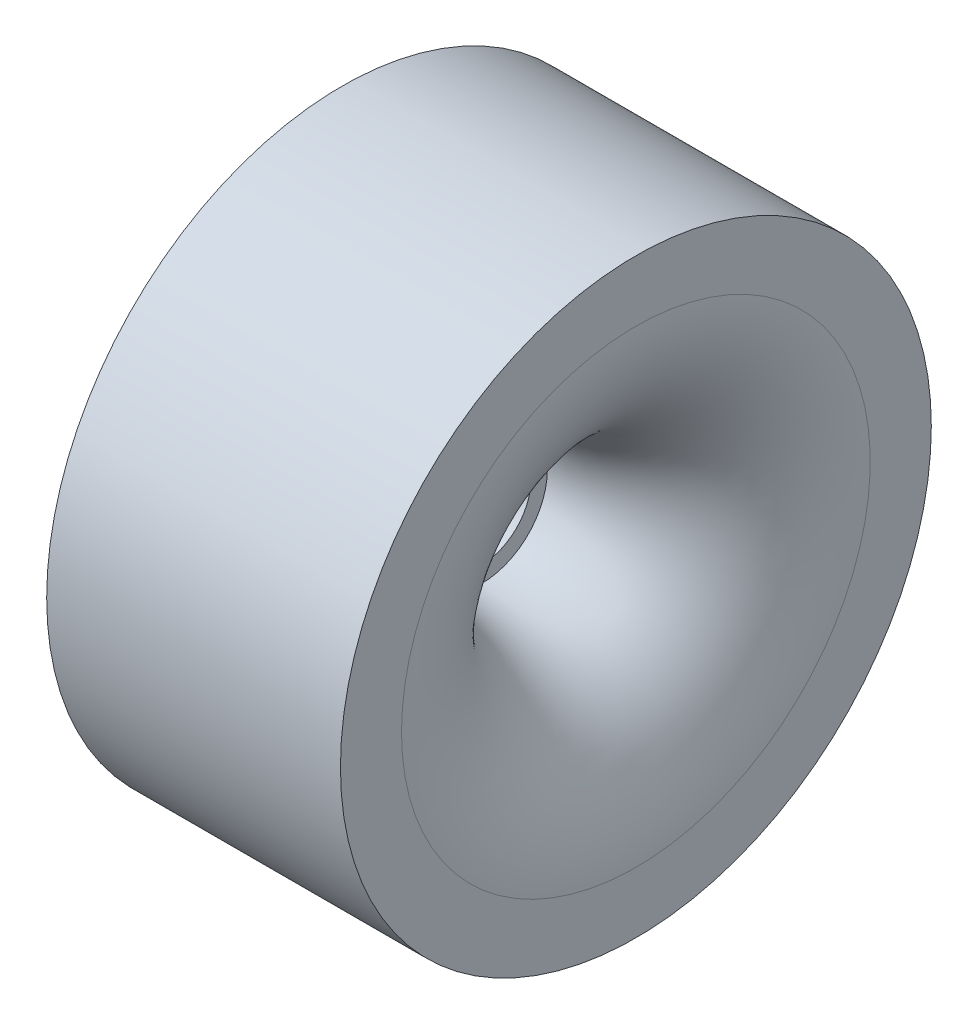
ISO-10303-21;
HEADER;
FILE_DESCRIPTION(('STEP AP214'),'2;1');
FILE_NAME('part.step','',(''),(''),'','','');
FILE_SCHEMA(('AUTOMOTIVE_DESIGN { 1 0 10303 214 1 1 1 1 }'));
ENDSEC;
DATA;
#1=APPLICATION_CONTEXT('core data for automotive mechanical design processes');
#2=APPLICATION_PROTOCOL_DEFINITION('international standard','automotive_design',2000,#1);
#3=PRODUCT_CONTEXT('',#1,'mechanical');
#4=PRODUCT('Part','Part','',(#3));
#5=PRODUCT_RELATED_PRODUCT_CATEGORY('part','',(#4));
#6=PRODUCT_DEFINITION_FORMATION('','',#4);
#7=PRODUCT_DEFINITION_CONTEXT('part definition',#1,'design');
#8=PRODUCT_DEFINITION('design','',#6,#7);
#9=PRODUCT_DEFINITION_SHAPE('','',#8);
#10=(LENGTH_UNIT() NAMED_UNIT(*) SI_UNIT(.MILLI.,.METRE.));
#11=(NAMED_UNIT(*) PLANE_ANGLE_UNIT() SI_UNIT($,.RADIAN.));
#12=(NAMED_UNIT(*) SI_UNIT($,.STERADIAN.) SOLID_ANGLE_UNIT());
#13=UNCERTAINTY_MEASURE_WITH_UNIT(LENGTH_MEASURE(1.E-05),#10,'distance_accuracy_value','');
#14=(GEOMETRIC_REPRESENTATION_CONTEXT(3) GLOBAL_UNCERTAINTY_ASSIGNED_CONTEXT((#13)) GLOBAL_UNIT_ASSIGNED_CONTEXT((#10,
#11,#12)) REPRESENTATION_CONTEXT('',''));
#15=CARTESIAN_POINT('',(0.,0.,0.));
#16=DIRECTION('',(0.,0.,1.));
#17=DIRECTION('',(1.,0.,0.));
#18=AXIS2_PLACEMENT_3D('',#15,#16,#17);
#19=CARTESIAN_POINT('',(-1.2624502584883,0.,0.));
#20=DIRECTION('',(-1.,0.,0.));
#21=DIRECTION('',(0.,0.,1.));
#22=AXIS2_PLACEMENT_3D('',#19,#20,#21);
#23=TOROIDAL_SURFACE('',#22,23.5424885289266,16.9327586047467);
#24=CARTESIAN_POINT('',(15.6677215353421,0.,0.));
#25=DIRECTION('',(-1.,0.,0.));
#26=DIRECTION('',(0.,0.,1.));
#27=AXIS2_PLACEMENT_3D('',#24,#25,#26);
#28=CIRCLE('',#27,23.8384564292343);
#29=CARTESIAN_POINT('',(15.6677215353421,0.,23.8384564292343));
#30=VERTEX_POINT('',#29);
#31=EDGE_CURVE('E58',#30,#30,#28,.T.);
#32=ORIENTED_EDGE('',*,*,#31,.F.);
#33=EDGE_LOOP('',(#32));
#34=FACE_BOUND('',#33,.T.);
#35=CARTESIAN_POINT('',(0.,0.,0.));
#36=DIRECTION('',(1.,0.,0.));
#37=DIRECTION('',(0.,0.,-1.));
#38=AXIS2_PLACEMENT_3D('',#35,#36,#37);
#39=CIRCLE('',#38,6.65685755725529);
#40=CARTESIAN_POINT('',(0.,0.,-6.65685755725529));
#41=VERTEX_POINT('',#40);
#42=EDGE_CURVE('E61',#41,#41,#39,.T.);
#43=ORIENTED_EDGE('',*,*,#42,.F.);
#44=EDGE_LOOP('',(#43));
#45=FACE_BOUND('',#44,.T.);
#46=ADVANCED_FACE('F36',(#34,#45),#23,.T.);
#47=CARTESIAN_POINT('',(1.18604739143028,0.,0.));
#48=DIRECTION('',(-1.,0.,0.));
#49=DIRECTION('',(0.,0.,1.));
#50=AXIS2_PLACEMENT_3D('',#47,#48,#49);
#51=TOROIDAL_SURFACE('',#50,22.5376224794024,12.0952546356603);
#52=CARTESIAN_POINT('',(0.,0.,0.));
#53=DIRECTION('',(-1.,0.,0.));
#54=DIRECTION('',(0.,0.,1.));
#55=AXIS2_PLACEMENT_3D('',#52,#53,#54);
#56=CIRCLE('',#55,10.5006595615089);
#57=CARTESIAN_POINT('',(0.,0.,10.5006595615089));
#58=VERTEX_POINT('',#57);
#59=EDGE_CURVE('E10',#58,#58,#56,.T.);
#60=ORIENTED_EDGE('',*,*,#59,.F.);
#61=EDGE_LOOP('',(#60));
#62=FACE_BOUND('',#61,.T.);
#63=CARTESIAN_POINT('',(13.2111467979394,0.,0.));
#64=DIRECTION('',(-1.,0.,0.));
#65=DIRECTION('',(0.,0.,1.));
#66=AXIS2_PLACEMENT_3D('',#63,#64,#65);
#67=CIRCLE('',#66,23.8384564292343);
#68=CARTESIAN_POINT('',(13.2111467979394,0.,23.8384564292343));
#69=VERTEX_POINT('',#68);
#70=EDGE_CURVE('E42',#69,#69,#67,.T.);
#71=ORIENTED_EDGE('',*,*,#70,.T.);
#72=EDGE_LOOP('',(#71));
#73=FACE_BOUND('',#72,.T.);
#74=ADVANCED_FACE('F94',(#62,#73),#51,.F.);
#75=CARTESIAN_POINT('',(0.,0.,0.));
#76=DIRECTION('',(-1.,0.,0.));
#77=DIRECTION('',(0.,0.,1.));
#78=AXIS2_PLACEMENT_3D('',#75,#76,#77);
#79=CYLINDRICAL_SURFACE('',#78,23.8384564292343);
#80=ORIENTED_EDGE('',*,*,#70,.F.);
#81=EDGE_LOOP('',(#80));
#82=FACE_BOUND('',#81,.T.);
#83=CARTESIAN_POINT('',(-14.2111467980044,0.,0.));
#84=DIRECTION('',(-1.,0.,0.));
#85=DIRECTION('',(0.,0.,1.));
#86=AXIS2_PLACEMENT_3D('',#83,#84,#85);
#87=CIRCLE('',#86,23.8384564292343);
#88=CARTESIAN_POINT('',(-14.2111467980044,0.,23.8384564292343));
#89=VERTEX_POINT('',#88);
#90=EDGE_CURVE('E46',#89,#89,#87,.T.);
#91=ORIENTED_EDGE('',*,*,#90,.T.);
#92=EDGE_LOOP('',(#91));
#93=FACE_BOUND('',#92,.T.);
#94=ADVANCED_FACE('F99',(#82,#93),#79,.F.);
#95=CARTESIAN_POINT('',(-14.2111467980044,23.8384564292343,0.));
#96=DIRECTION('',(1.,0.,0.));
#97=DIRECTION('',(0.,0.,-1.));
#98=AXIS2_PLACEMENT_3D('',#95,#96,#97);
#99=PLANE('',#98);
#100=ORIENTED_EDGE('',*,*,#90,.F.);
#101=EDGE_LOOP('',(#100));
#102=FACE_BOUND('',#101,.T.);
#103=CARTESIAN_POINT('',(-14.2111467980044,0.,0.));
#104=DIRECTION('',(-1.,0.,0.));
#105=DIRECTION('',(0.,0.,1.));
#106=AXIS2_PLACEMENT_3D('',#103,#104,#105);
#107=CIRCLE('',#106,30.0505153817667);
#108=CARTESIAN_POINT('',(-14.2111467980044,0.,30.0505153817667));
#109=VERTEX_POINT('',#108);
#110=EDGE_CURVE('E50',#109,#109,#107,.T.);
#111=ORIENTED_EDGE('',*,*,#110,.T.);
#112=EDGE_LOOP('',(#111));
#113=FACE_BOUND('',#112,.T.);
#114=ADVANCED_FACE('F113',(#102,#113),#99,.F.);
#115=CARTESIAN_POINT('',(0.,0.,0.));
#116=DIRECTION('',(-1.,0.,0.));
#117=DIRECTION('',(0.,0.,1.));
#118=AXIS2_PLACEMENT_3D('',#115,#116,#117);
#119=CYLINDRICAL_SURFACE('',#118,30.0505153817667);
#120=ORIENTED_EDGE('',*,*,#110,.F.);
#121=EDGE_LOOP('',(#120));
#122=FACE_BOUND('',#121,.T.);
#123=CARTESIAN_POINT('',(15.6677215353421,0.,0.));
#124=DIRECTION('',(-1.,0.,0.));
#125=DIRECTION('',(0.,0.,1.));
#126=AXIS2_PLACEMENT_3D('',#123,#124,#125);
#127=CIRCLE('',#126,30.0505153817667);
#128=CARTESIAN_POINT('',(15.6677215353421,0.,30.0505153817667));
#129=VERTEX_POINT('',#128);
#130=EDGE_CURVE('E55',#129,#129,#127,.T.);
#131=ORIENTED_EDGE('',*,*,#130,.T.);
#132=EDGE_LOOP('',(#131));
#133=FACE_BOUND('',#132,.T.);
#134=ADVANCED_FACE('F107',(#122,#133),#119,.T.);
#135=CARTESIAN_POINT('',(15.6677215353421,30.0505153817667,0.));
#136=DIRECTION('',(-1.,0.,0.));
#137=DIRECTION('',(0.,0.,1.));
#138=AXIS2_PLACEMENT_3D('',#135,#136,#137);
#139=PLANE('',#138);
#140=ORIENTED_EDGE('',*,*,#130,.F.);
#141=EDGE_LOOP('',(#140));
#142=FACE_BOUND('',#141,.T.);
#143=ORIENTED_EDGE('',*,*,#31,.T.);
#144=EDGE_LOOP('',(#143));
#145=FACE_BOUND('',#144,.T.);
#146=ADVANCED_FACE('F89',(#142,#145),#139,.F.);
#147=CARTESIAN_POINT('',(0.,0.,0.));
#148=DIRECTION('',(-1.,0.,0.));
#149=DIRECTION('',(0.,0.,1.));
#150=AXIS2_PLACEMENT_3D('',#147,#148,#149);
#151=PLANE('',#150);
#152=CARTESIAN_POINT('',(0.,0.,0.));
#153=DIRECTION('',(-1.,0.,0.));
#154=DIRECTION('',(0.,0.,1.));
#155=AXIS2_PLACEMENT_3D('',#152,#153,#154);
#156=CIRCLE('',#155,5.);
#157=CARTESIAN_POINT('',(0.,0.,5.));
#158=VERTEX_POINT('',#157);
#159=EDGE_CURVE('E68',#158,#158,#156,.T.);
#160=ORIENTED_EDGE('',*,*,#159,.T.);
#161=EDGE_LOOP('',(#160));
#162=FACE_BOUND('',#161,.T.);
#163=ORIENTED_EDGE('',*,*,#42,.T.);
#164=EDGE_LOOP('',(#163));
#165=FACE_BOUND('',#164,.T.);
#166=ADVANCED_FACE('F80',(#162,#165),#151,.F.);
#167=CARTESIAN_POINT('',(-13.1827875075647,0.,0.));
#168=DIRECTION('',(-1.,0.,0.));
#169=DIRECTION('',(0.,0.,1.));
#170=AXIS2_PLACEMENT_3D('',#167,#168,#169);
#171=PLANE('',#170);
#172=CARTESIAN_POINT('',(-13.1827875075647,0.,0.));
#173=DIRECTION('',(-1.,0.,0.));
#174=DIRECTION('',(0.,0.,1.));
#175=AXIS2_PLACEMENT_3D('',#172,#173,#174);
#176=CIRCLE('',#175,10.5006595615089);
#177=CARTESIAN_POINT('',(-13.1827875075647,0.,10.5006595615089));
#178=VERTEX_POINT('',#177);
#179=EDGE_CURVE('E64',#178,#178,#176,.T.);
#180=ORIENTED_EDGE('',*,*,#179,.T.);
#181=EDGE_LOOP('',(#180));
#182=FACE_BOUND('',#181,.T.);
#183=CARTESIAN_POINT('',(-13.1827875075647,0.,0.));
#184=DIRECTION('',(-1.,0.,0.));
#185=DIRECTION('',(0.,0.,1.));
#186=AXIS2_PLACEMENT_3D('',#183,#184,#185);
#187=CIRCLE('',#186,5.);
#188=CARTESIAN_POINT('',(-13.1827875075647,0.,5.));
#189=VERTEX_POINT('',#188);
#190=EDGE_CURVE('E67',#189,#189,#187,.T.);
#191=ORIENTED_EDGE('',*,*,#190,.F.);
#192=EDGE_LOOP('',(#191));
#193=FACE_BOUND('',#192,.T.);
#194=ADVANCED_FACE('F77',(#182,#193),#171,.T.);
#195=CARTESIAN_POINT('',(-13.1827875075647,0.,0.));
#196=DIRECTION('',(1.,0.,0.));
#197=DIRECTION('',(0.,0.,-1.));
#198=AXIS2_PLACEMENT_3D('',#195,#196,#197);
#199=CYLINDRICAL_SURFACE('',#198,10.5006595615089);
#200=ORIENTED_EDGE('',*,*,#179,.F.);
#201=EDGE_LOOP('',(#200));
#202=FACE_BOUND('',#201,.T.);
#203=ORIENTED_EDGE('',*,*,#59,.T.);
#204=EDGE_LOOP('',(#203));
#205=FACE_BOUND('',#204,.T.);
#206=ADVANCED_FACE('F79',(#202,#205),#199,.T.);
#207=CARTESIAN_POINT('',(-13.1827875075647,0.,0.));
#208=DIRECTION('',(1.,0.,0.));
#209=DIRECTION('',(0.,0.,-1.));
#210=AXIS2_PLACEMENT_3D('',#207,#208,#209);
#211=CYLINDRICAL_SURFACE('',#210,5.);
#212=ORIENTED_EDGE('',*,*,#190,.T.);
#213=EDGE_LOOP('',(#212));
#214=FACE_BOUND('',#213,.T.);
#215=ORIENTED_EDGE('',*,*,#159,.F.);
#216=EDGE_LOOP('',(#215));
#217=FACE_BOUND('',#216,.T.);
#218=ADVANCED_FACE('F74',(#214,#217),#211,.F.);
#219=CLOSED_SHELL('',(#46,#74,#94,#114,#134,#146,#166,#194,#206,#218));
#220=MANIFOLD_SOLID_BREP('B2',#219);
#221=ADVANCED_BREP_SHAPE_REPRESENTATION('',(#18,#220),#14);
#222=SHAPE_DEFINITION_REPRESENTATION(#9,#221);
ENDSEC;
END-ISO-10303-21;
